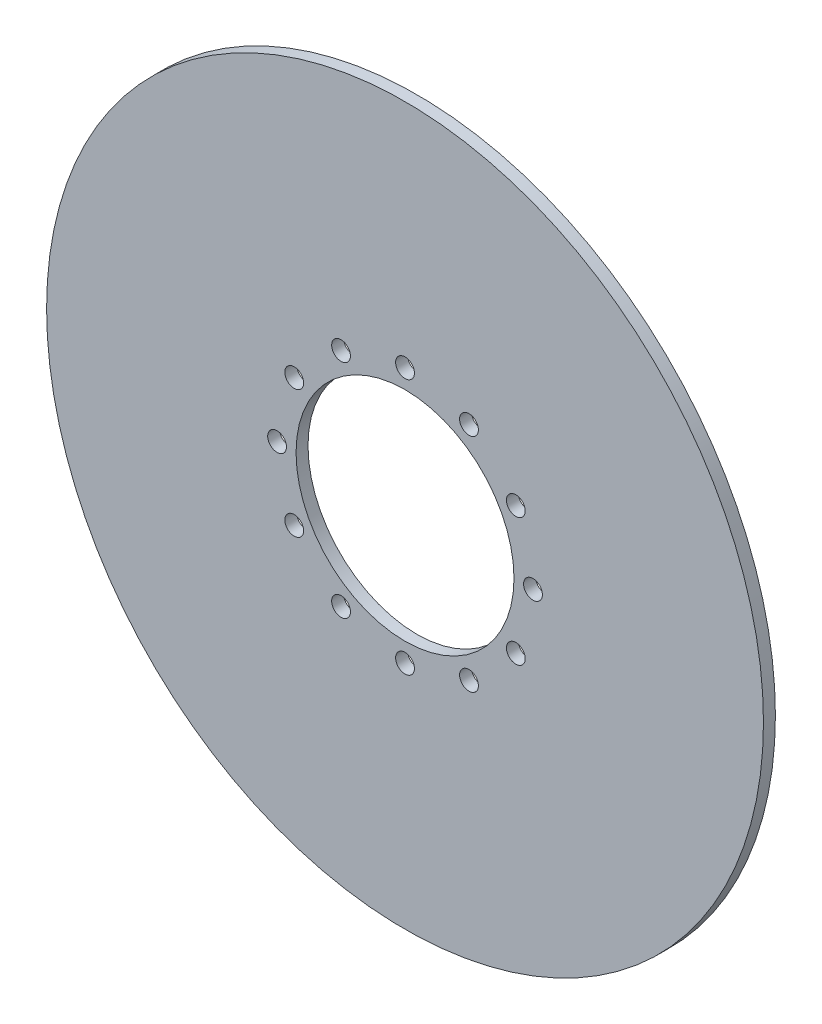
ISO-10303-21;
HEADER;
FILE_DESCRIPTION(('STEP AP214'),'2;1');
FILE_NAME('part.step','',(''),(''),'','','');
FILE_SCHEMA(('AUTOMOTIVE_DESIGN { 1 0 10303 214 1 1 1 1 }'));
ENDSEC;
DATA;
#1=APPLICATION_CONTEXT('core data for automotive mechanical design processes');
#2=APPLICATION_PROTOCOL_DEFINITION('international standard','automotive_design',2000,#1);
#3=PRODUCT_CONTEXT('',#1,'mechanical');
#4=PRODUCT('Part','Part','',(#3));
#5=PRODUCT_RELATED_PRODUCT_CATEGORY('part','',(#4));
#6=PRODUCT_DEFINITION_FORMATION('','',#4);
#7=PRODUCT_DEFINITION_CONTEXT('part definition',#1,'design');
#8=PRODUCT_DEFINITION('design','',#6,#7);
#9=PRODUCT_DEFINITION_SHAPE('','',#8);
#10=(LENGTH_UNIT() NAMED_UNIT(*) SI_UNIT(.MILLI.,.METRE.));
#11=(NAMED_UNIT(*) PLANE_ANGLE_UNIT() SI_UNIT($,.RADIAN.));
#12=(NAMED_UNIT(*) SI_UNIT($,.STERADIAN.) SOLID_ANGLE_UNIT());
#13=UNCERTAINTY_MEASURE_WITH_UNIT(LENGTH_MEASURE(1.E-05),#10,'distance_accuracy_value','');
#14=(GEOMETRIC_REPRESENTATION_CONTEXT(3) GLOBAL_UNCERTAINTY_ASSIGNED_CONTEXT((#13)) GLOBAL_UNIT_ASSIGNED_CONTEXT((#10,
#11,#12)) REPRESENTATION_CONTEXT('',''));
#15=CARTESIAN_POINT('',(0.,0.,0.));
#16=DIRECTION('',(0.,0.,1.));
#17=DIRECTION('',(1.,0.,0.));
#18=AXIS2_PLACEMENT_3D('',#15,#16,#17);
#19=CARTESIAN_POINT('',(0.,0.,3.175));
#20=DIRECTION('',(0.,0.,1.));
#21=DIRECTION('',(1.,0.,0.));
#22=AXIS2_PLACEMENT_3D('',#19,#20,#21);
#23=PLANE('',#22);
#24=CARTESIAN_POINT('',(-29.4448637286702,16.9999999999987,3.175));
#25=DIRECTION('',(0.,0.,1.));
#26=DIRECTION('',(1.,0.,0.));
#27=AXIS2_PLACEMENT_3D('',#24,#25,#26);
#28=CIRCLE('',#27,2.49698906987796);
#29=CARTESIAN_POINT('',(-26.9478746587923,16.9999999999987,3.175));
#30=VERTEX_POINT('',#29);
#31=EDGE_CURVE('E106',#30,#30,#28,.T.);
#32=ORIENTED_EDGE('',*,*,#31,.F.);
#33=EDGE_LOOP('',(#32));
#34=FACE_BOUND('',#33,.T.);
#35=CARTESIAN_POINT('',(-29.4448637286688,-17.0000000000013,3.175));
#36=DIRECTION('',(0.,0.,1.));
#37=DIRECTION('',(1.,0.,0.));
#38=AXIS2_PLACEMENT_3D('',#35,#36,#37);
#39=CIRCLE('',#38,2.49698906987796);
#40=CARTESIAN_POINT('',(-26.9478746587908,-17.0000000000013,3.175));
#41=VERTEX_POINT('',#40);
#42=EDGE_CURVE('E94',#41,#41,#39,.T.);
#43=ORIENTED_EDGE('',*,*,#42,.F.);
#44=EDGE_LOOP('',(#43));
#45=FACE_BOUND('',#44,.T.);
#46=CARTESIAN_POINT('',(2.86804195578331E-12,-34.,3.175));
#47=DIRECTION('',(0.,0.,1.));
#48=DIRECTION('',(1.,0.,0.));
#49=AXIS2_PLACEMENT_3D('',#46,#47,#48);
#50=CIRCLE('',#49,2.49698906987796);
#51=CARTESIAN_POINT('',(2.49698906988083,-34.,3.175));
#52=VERTEX_POINT('',#51);
#53=EDGE_CURVE('E82',#52,#52,#50,.T.);
#54=ORIENTED_EDGE('',*,*,#53,.F.);
#55=EDGE_LOOP('',(#54));
#56=FACE_BOUND('',#55,.T.);
#57=CARTESIAN_POINT('',(29.4448637286731,-16.9999999999988,3.175));
#58=DIRECTION('',(0.,0.,1.));
#59=DIRECTION('',(1.,0.,0.));
#60=AXIS2_PLACEMENT_3D('',#57,#58,#59);
#61=CIRCLE('',#60,2.49698906987769);
#62=CARTESIAN_POINT('',(31.9418527985508,-16.9999999999988,3.175));
#63=VERTEX_POINT('',#62);
#64=EDGE_CURVE('E70',#63,#63,#61,.T.);
#65=ORIENTED_EDGE('',*,*,#64,.F.);
#66=EDGE_LOOP('',(#65));
#67=FACE_BOUND('',#66,.T.);
#68=CARTESIAN_POINT('',(29.4448637286716,17.0000000000012,3.175));
#69=DIRECTION('',(0.,0.,1.));
#70=DIRECTION('',(1.,0.,0.));
#71=AXIS2_PLACEMENT_3D('',#68,#69,#70);
#72=CIRCLE('',#71,2.49698906987796);
#73=CARTESIAN_POINT('',(31.9418527985496,17.0000000000012,3.175));
#74=VERTEX_POINT('',#73);
#75=EDGE_CURVE('E58',#74,#74,#72,.T.);
#76=ORIENTED_EDGE('',*,*,#75,.F.);
#77=EDGE_LOOP('',(#76));
#78=FACE_BOUND('',#77,.T.);
#79=CARTESIAN_POINT('',(0.,34.,3.175));
#80=DIRECTION('',(0.,0.,1.));
#81=DIRECTION('',(1.,0.,0.));
#82=AXIS2_PLACEMENT_3D('',#79,#80,#81);
#83=CIRCLE('',#82,2.49698906987796);
#84=CARTESIAN_POINT('',(2.49698906987796,34.,3.175));
#85=VERTEX_POINT('',#84);
#86=EDGE_CURVE('E46',#85,#85,#83,.T.);
#87=ORIENTED_EDGE('',*,*,#86,.F.);
#88=EDGE_LOOP('',(#87));
#89=FACE_BOUND('',#88,.T.);
#90=CARTESIAN_POINT('',(0.,0.,3.175));
#91=DIRECTION('',(0.,0.,1.));
#92=DIRECTION('',(1.,0.,0.));
#93=AXIS2_PLACEMENT_3D('',#90,#91,#92);
#94=CIRCLE('',#93,95.25);
#95=CARTESIAN_POINT('',(95.25,0.,3.175));
#96=VERTEX_POINT('',#95);
#97=EDGE_CURVE('E10',#96,#96,#94,.T.);
#98=ORIENTED_EDGE('',*,*,#97,.T.);
#99=EDGE_LOOP('',(#98));
#100=FACE_BOUND('',#99,.T.);
#101=CARTESIAN_POINT('',(0.,0.,3.175));
#102=DIRECTION('',(0.,0.,1.));
#103=DIRECTION('',(1.,0.,0.));
#104=AXIS2_PLACEMENT_3D('',#101,#102,#103);
#105=CIRCLE('',#104,28.956);
#106=CARTESIAN_POINT('',(28.956,0.,3.175));
#107=VERTEX_POINT('',#106);
#108=EDGE_CURVE('E41',#107,#107,#105,.T.);
#109=ORIENTED_EDGE('',*,*,#108,.F.);
#110=EDGE_LOOP('',(#109));
#111=FACE_BOUND('',#110,.T.);
#112=CARTESIAN_POINT('',(17.0000000000002,29.4448637286716,3.175));
#113=DIRECTION('',(0.,0.,1.));
#114=DIRECTION('',(1.,0.,0.));
#115=AXIS2_PLACEMENT_3D('',#112,#113,#114);
#116=CIRCLE('',#115,2.49698906987796);
#117=CARTESIAN_POINT('',(19.4969890698782,29.4448637286716,3.175));
#118=VERTEX_POINT('',#117);
#119=EDGE_CURVE('E52',#118,#118,#116,.T.);
#120=ORIENTED_EDGE('',*,*,#119,.F.);
#121=EDGE_LOOP('',(#120));
#122=FACE_BOUND('',#121,.T.);
#123=CARTESIAN_POINT('',(34.0000000000014,1.43402097789165E-12,3.175));
#124=DIRECTION('',(0.,0.,1.));
#125=DIRECTION('',(1.,0.,0.));
#126=AXIS2_PLACEMENT_3D('',#123,#124,#125);
#127=CIRCLE('',#126,2.49698906987796);
#128=CARTESIAN_POINT('',(36.4969890698794,1.43402097789165E-12,3.175));
#129=VERTEX_POINT('',#128);
#130=EDGE_CURVE('E64',#129,#129,#127,.T.);
#131=ORIENTED_EDGE('',*,*,#130,.F.);
#132=EDGE_LOOP('',(#131));
#133=FACE_BOUND('',#132,.T.);
#134=CARTESIAN_POINT('',(17.0000000000027,-29.4448637286702,3.175));
#135=DIRECTION('',(0.,0.,1.));
#136=DIRECTION('',(1.,0.,0.));
#137=AXIS2_PLACEMENT_3D('',#134,#135,#136);
#138=CIRCLE('',#137,2.49698906987837);
#139=CARTESIAN_POINT('',(19.4969890698811,-29.4448637286702,3.175));
#140=VERTEX_POINT('',#139);
#141=EDGE_CURVE('E76',#140,#140,#138,.T.);
#142=ORIENTED_EDGE('',*,*,#141,.F.);
#143=EDGE_LOOP('',(#142));
#144=FACE_BOUND('',#143,.T.);
#145=CARTESIAN_POINT('',(-16.9999999999973,-29.4448637286716,3.175));
#146=DIRECTION('',(0.,0.,1.));
#147=DIRECTION('',(1.,0.,0.));
#148=AXIS2_PLACEMENT_3D('',#145,#146,#147);
#149=CIRCLE('',#148,2.49698906987796);
#150=CARTESIAN_POINT('',(-14.5030109301194,-29.4448637286716,3.175));
#151=VERTEX_POINT('',#150);
#152=EDGE_CURVE('E88',#151,#151,#149,.T.);
#153=ORIENTED_EDGE('',*,*,#152,.F.);
#154=EDGE_LOOP('',(#153));
#155=FACE_BOUND('',#154,.T.);
#156=CARTESIAN_POINT('',(-33.9999999999986,-1.43818477700875E-12,3.175));
#157=DIRECTION('',(0.,0.,1.));
#158=DIRECTION('',(1.,0.,0.));
#159=AXIS2_PLACEMENT_3D('',#156,#157,#158);
#160=CIRCLE('',#159,2.49698906987796);
#161=CARTESIAN_POINT('',(-31.5030109301206,-1.43818477700875E-12,3.175));
#162=VERTEX_POINT('',#161);
#163=EDGE_CURVE('E100',#162,#162,#160,.T.);
#164=ORIENTED_EDGE('',*,*,#163,.F.);
#165=EDGE_LOOP('',(#164));
#166=FACE_BOUND('',#165,.T.);
#167=CARTESIAN_POINT('',(-16.9999999999998,29.4448637286702,3.175));
#168=DIRECTION('',(0.,0.,1.));
#169=DIRECTION('',(1.,0.,0.));
#170=AXIS2_PLACEMENT_3D('',#167,#168,#169);
#171=CIRCLE('',#170,2.49698906987796);
#172=CARTESIAN_POINT('',(-14.5030109301219,29.4448637286702,3.175));
#173=VERTEX_POINT('',#172);
#174=EDGE_CURVE('E112',#173,#173,#171,.T.);
#175=ORIENTED_EDGE('',*,*,#174,.F.);
#176=EDGE_LOOP('',(#175));
#177=FACE_BOUND('',#176,.T.);
#178=ADVANCED_FACE('F30',(#34,#45,#56,#67,#78,#89,#100,#111,#122,#133,#144,#155,#166,#177),#23,.T.);
#179=CARTESIAN_POINT('',(0.,0.,0.));
#180=DIRECTION('',(0.,0.,1.));
#181=DIRECTION('',(1.,0.,0.));
#182=AXIS2_PLACEMENT_3D('',#179,#180,#181);
#183=PLANE('',#182);
#184=CARTESIAN_POINT('',(0.,0.,0.));
#185=DIRECTION('',(0.,0.,1.));
#186=DIRECTION('',(1.,0.,0.));
#187=AXIS2_PLACEMENT_3D('',#184,#185,#186);
#188=CIRCLE('',#187,95.25);
#189=CARTESIAN_POINT('',(95.25,0.,0.));
#190=VERTEX_POINT('',#189);
#191=EDGE_CURVE('E34',#190,#190,#188,.T.);
#192=ORIENTED_EDGE('',*,*,#191,.F.);
#193=EDGE_LOOP('',(#192));
#194=FACE_BOUND('',#193,.T.);
#195=CARTESIAN_POINT('',(0.,0.,0.));
#196=DIRECTION('',(0.,0.,1.));
#197=DIRECTION('',(1.,0.,0.));
#198=AXIS2_PLACEMENT_3D('',#195,#196,#197);
#199=CIRCLE('',#198,28.956);
#200=CARTESIAN_POINT('',(28.956,0.,0.));
#201=VERTEX_POINT('',#200);
#202=EDGE_CURVE('E43',#201,#201,#199,.T.);
#203=ORIENTED_EDGE('',*,*,#202,.T.);
#204=EDGE_LOOP('',(#203));
#205=FACE_BOUND('',#204,.T.);
#206=CARTESIAN_POINT('',(0.,34.,0.));
#207=DIRECTION('',(0.,0.,1.));
#208=DIRECTION('',(1.,0.,0.));
#209=AXIS2_PLACEMENT_3D('',#206,#207,#208);
#210=CIRCLE('',#209,2.49698906987796);
#211=CARTESIAN_POINT('',(2.49698906987796,34.,0.));
#212=VERTEX_POINT('',#211);
#213=EDGE_CURVE('E49',#212,#212,#210,.T.);
#214=ORIENTED_EDGE('',*,*,#213,.T.);
#215=EDGE_LOOP('',(#214));
#216=FACE_BOUND('',#215,.T.);
#217=CARTESIAN_POINT('',(17.0000000000002,29.4448637286716,0.));
#218=DIRECTION('',(0.,0.,1.));
#219=DIRECTION('',(1.,0.,0.));
#220=AXIS2_PLACEMENT_3D('',#217,#218,#219);
#221=CIRCLE('',#220,2.49698906987796);
#222=CARTESIAN_POINT('',(19.4969890698782,29.4448637286716,0.));
#223=VERTEX_POINT('',#222);
#224=EDGE_CURVE('E55',#223,#223,#221,.T.);
#225=ORIENTED_EDGE('',*,*,#224,.T.);
#226=EDGE_LOOP('',(#225));
#227=FACE_BOUND('',#226,.T.);
#228=CARTESIAN_POINT('',(29.4448637286716,17.0000000000012,0.));
#229=DIRECTION('',(0.,0.,1.));
#230=DIRECTION('',(1.,0.,0.));
#231=AXIS2_PLACEMENT_3D('',#228,#229,#230);
#232=CIRCLE('',#231,2.49698906987796);
#233=CARTESIAN_POINT('',(31.9418527985496,17.0000000000012,0.));
#234=VERTEX_POINT('',#233);
#235=EDGE_CURVE('E61',#234,#234,#232,.T.);
#236=ORIENTED_EDGE('',*,*,#235,.T.);
#237=EDGE_LOOP('',(#236));
#238=FACE_BOUND('',#237,.T.);
#239=CARTESIAN_POINT('',(34.0000000000014,1.43402097789165E-12,0.));
#240=DIRECTION('',(0.,0.,1.));
#241=DIRECTION('',(1.,0.,0.));
#242=AXIS2_PLACEMENT_3D('',#239,#240,#241);
#243=CIRCLE('',#242,2.49698906987796);
#244=CARTESIAN_POINT('',(36.4969890698794,1.43402097789165E-12,0.));
#245=VERTEX_POINT('',#244);
#246=EDGE_CURVE('E67',#245,#245,#243,.T.);
#247=ORIENTED_EDGE('',*,*,#246,.T.);
#248=EDGE_LOOP('',(#247));
#249=FACE_BOUND('',#248,.T.);
#250=CARTESIAN_POINT('',(29.4448637286731,-16.9999999999988,0.));
#251=DIRECTION('',(0.,0.,1.));
#252=DIRECTION('',(1.,0.,0.));
#253=AXIS2_PLACEMENT_3D('',#250,#251,#252);
#254=CIRCLE('',#253,2.49698906987769);
#255=CARTESIAN_POINT('',(31.9418527985508,-16.9999999999988,0.));
#256=VERTEX_POINT('',#255);
#257=EDGE_CURVE('E73',#256,#256,#254,.T.);
#258=ORIENTED_EDGE('',*,*,#257,.T.);
#259=EDGE_LOOP('',(#258));
#260=FACE_BOUND('',#259,.T.);
#261=CARTESIAN_POINT('',(17.0000000000027,-29.4448637286702,0.));
#262=DIRECTION('',(0.,0.,1.));
#263=DIRECTION('',(1.,0.,0.));
#264=AXIS2_PLACEMENT_3D('',#261,#262,#263);
#265=CIRCLE('',#264,2.49698906987837);
#266=CARTESIAN_POINT('',(19.4969890698811,-29.4448637286702,0.));
#267=VERTEX_POINT('',#266);
#268=EDGE_CURVE('E79',#267,#267,#265,.T.);
#269=ORIENTED_EDGE('',*,*,#268,.T.);
#270=EDGE_LOOP('',(#269));
#271=FACE_BOUND('',#270,.T.);
#272=CARTESIAN_POINT('',(2.86804195578331E-12,-34.,0.));
#273=DIRECTION('',(0.,0.,1.));
#274=DIRECTION('',(1.,0.,0.));
#275=AXIS2_PLACEMENT_3D('',#272,#273,#274);
#276=CIRCLE('',#275,2.49698906987796);
#277=CARTESIAN_POINT('',(2.49698906988083,-34.,0.));
#278=VERTEX_POINT('',#277);
#279=EDGE_CURVE('E85',#278,#278,#276,.T.);
#280=ORIENTED_EDGE('',*,*,#279,.T.);
#281=EDGE_LOOP('',(#280));
#282=FACE_BOUND('',#281,.T.);
#283=CARTESIAN_POINT('',(-16.9999999999973,-29.4448637286716,0.));
#284=DIRECTION('',(0.,0.,1.));
#285=DIRECTION('',(1.,0.,0.));
#286=AXIS2_PLACEMENT_3D('',#283,#284,#285);
#287=CIRCLE('',#286,2.49698906987796);
#288=CARTESIAN_POINT('',(-14.5030109301194,-29.4448637286716,0.));
#289=VERTEX_POINT('',#288);
#290=EDGE_CURVE('E91',#289,#289,#287,.T.);
#291=ORIENTED_EDGE('',*,*,#290,.T.);
#292=EDGE_LOOP('',(#291));
#293=FACE_BOUND('',#292,.T.);
#294=CARTESIAN_POINT('',(-29.4448637286688,-17.0000000000013,0.));
#295=DIRECTION('',(0.,0.,1.));
#296=DIRECTION('',(1.,0.,0.));
#297=AXIS2_PLACEMENT_3D('',#294,#295,#296);
#298=CIRCLE('',#297,2.49698906987796);
#299=CARTESIAN_POINT('',(-26.9478746587908,-17.0000000000013,0.));
#300=VERTEX_POINT('',#299);
#301=EDGE_CURVE('E97',#300,#300,#298,.T.);
#302=ORIENTED_EDGE('',*,*,#301,.T.);
#303=EDGE_LOOP('',(#302));
#304=FACE_BOUND('',#303,.T.);
#305=CARTESIAN_POINT('',(-33.9999999999986,-1.43818477700875E-12,0.));
#306=DIRECTION('',(0.,0.,1.));
#307=DIRECTION('',(1.,0.,0.));
#308=AXIS2_PLACEMENT_3D('',#305,#306,#307);
#309=CIRCLE('',#308,2.49698906987796);
#310=CARTESIAN_POINT('',(-31.5030109301206,-1.43818477700875E-12,0.));
#311=VERTEX_POINT('',#310);
#312=EDGE_CURVE('E103',#311,#311,#309,.T.);
#313=ORIENTED_EDGE('',*,*,#312,.T.);
#314=EDGE_LOOP('',(#313));
#315=FACE_BOUND('',#314,.T.);
#316=CARTESIAN_POINT('',(-29.4448637286702,16.9999999999987,0.));
#317=DIRECTION('',(0.,0.,1.));
#318=DIRECTION('',(1.,0.,0.));
#319=AXIS2_PLACEMENT_3D('',#316,#317,#318);
#320=CIRCLE('',#319,2.49698906987796);
#321=CARTESIAN_POINT('',(-26.9478746587923,16.9999999999987,0.));
#322=VERTEX_POINT('',#321);
#323=EDGE_CURVE('E109',#322,#322,#320,.T.);
#324=ORIENTED_EDGE('',*,*,#323,.T.);
#325=EDGE_LOOP('',(#324));
#326=FACE_BOUND('',#325,.T.);
#327=CARTESIAN_POINT('',(-16.9999999999998,29.4448637286702,0.));
#328=DIRECTION('',(0.,0.,1.));
#329=DIRECTION('',(1.,0.,0.));
#330=AXIS2_PLACEMENT_3D('',#327,#328,#329);
#331=CIRCLE('',#330,2.49698906987796);
#332=CARTESIAN_POINT('',(-14.5030109301219,29.4448637286702,0.));
#333=VERTEX_POINT('',#332);
#334=EDGE_CURVE('E115',#333,#333,#331,.T.);
#335=ORIENTED_EDGE('',*,*,#334,.T.);
#336=EDGE_LOOP('',(#335));
#337=FACE_BOUND('',#336,.T.);
#338=ADVANCED_FACE('F125',(#194,#205,#216,#227,#238,#249,#260,#271,#282,#293,#304,#315,#326,
#337),#183,.F.);
#339=CARTESIAN_POINT('',(0.,0.,3.175));
#340=DIRECTION('',(0.,0.,-1.));
#341=DIRECTION('',(-1.,0.,0.));
#342=AXIS2_PLACEMENT_3D('',#339,#340,#341);
#343=CYLINDRICAL_SURFACE('',#342,95.25);
#344=ORIENTED_EDGE('',*,*,#97,.F.);
#345=EDGE_LOOP('',(#344));
#346=FACE_BOUND('',#345,.T.);
#347=ORIENTED_EDGE('',*,*,#191,.T.);
#348=EDGE_LOOP('',(#347));
#349=FACE_BOUND('',#348,.T.);
#350=ADVANCED_FACE('F32',(#346,#349),#343,.T.);
#351=CARTESIAN_POINT('',(0.,0.,3.175));
#352=DIRECTION('',(0.,0.,-1.));
#353=DIRECTION('',(-1.,0.,0.));
#354=AXIS2_PLACEMENT_3D('',#351,#352,#353);
#355=CYLINDRICAL_SURFACE('',#354,28.956);
#356=ORIENTED_EDGE('',*,*,#108,.T.);
#357=EDGE_LOOP('',(#356));
#358=FACE_BOUND('',#357,.T.);
#359=ORIENTED_EDGE('',*,*,#202,.F.);
#360=EDGE_LOOP('',(#359));
#361=FACE_BOUND('',#360,.T.);
#362=ADVANCED_FACE('F135',(#358,#361),#355,.F.);
#363=CARTESIAN_POINT('',(0.,34.,3.175));
#364=DIRECTION('',(0.,0.,-1.));
#365=DIRECTION('',(-1.,0.,0.));
#366=AXIS2_PLACEMENT_3D('',#363,#364,#365);
#367=CYLINDRICAL_SURFACE('',#366,2.49698906987796);
#368=ORIENTED_EDGE('',*,*,#86,.T.);
#369=EDGE_LOOP('',(#368));
#370=FACE_BOUND('',#369,.T.);
#371=ORIENTED_EDGE('',*,*,#213,.F.);
#372=EDGE_LOOP('',(#371));
#373=FACE_BOUND('',#372,.T.);
#374=ADVANCED_FACE('F138',(#370,#373),#367,.F.);
#375=CARTESIAN_POINT('',(17.0000000000002,29.4448637286716,3.175));
#376=DIRECTION('',(0.,0.,-1.));
#377=DIRECTION('',(-1.,0.,0.));
#378=AXIS2_PLACEMENT_3D('',#375,#376,#377);
#379=CYLINDRICAL_SURFACE('',#378,2.49698906987796);
#380=ORIENTED_EDGE('',*,*,#119,.T.);
#381=EDGE_LOOP('',(#380));
#382=FACE_BOUND('',#381,.T.);
#383=ORIENTED_EDGE('',*,*,#224,.F.);
#384=EDGE_LOOP('',(#383));
#385=FACE_BOUND('',#384,.T.);
#386=ADVANCED_FACE('F142',(#382,#385),#379,.F.);
#387=CARTESIAN_POINT('',(29.4448637286716,17.0000000000012,3.175));
#388=DIRECTION('',(0.,0.,-1.));
#389=DIRECTION('',(-1.,0.,0.));
#390=AXIS2_PLACEMENT_3D('',#387,#388,#389);
#391=CYLINDRICAL_SURFACE('',#390,2.49698906987796);
#392=ORIENTED_EDGE('',*,*,#75,.T.);
#393=EDGE_LOOP('',(#392));
#394=FACE_BOUND('',#393,.T.);
#395=ORIENTED_EDGE('',*,*,#235,.F.);
#396=EDGE_LOOP('',(#395));
#397=FACE_BOUND('',#396,.T.);
#398=ADVANCED_FACE('F146',(#394,#397),#391,.F.);
#399=CARTESIAN_POINT('',(34.0000000000014,1.43402097789165E-12,3.175));
#400=DIRECTION('',(0.,0.,-1.));
#401=DIRECTION('',(-1.,0.,0.));
#402=AXIS2_PLACEMENT_3D('',#399,#400,#401);
#403=CYLINDRICAL_SURFACE('',#402,2.49698906987796);
#404=ORIENTED_EDGE('',*,*,#130,.T.);
#405=EDGE_LOOP('',(#404));
#406=FACE_BOUND('',#405,.T.);
#407=ORIENTED_EDGE('',*,*,#246,.F.);
#408=EDGE_LOOP('',(#407));
#409=FACE_BOUND('',#408,.T.);
#410=ADVANCED_FACE('F150',(#406,#409),#403,.F.);
#411=CARTESIAN_POINT('',(29.4448637286731,-16.9999999999988,3.175));
#412=DIRECTION('',(0.,0.,-1.));
#413=DIRECTION('',(-1.,0.,0.));
#414=AXIS2_PLACEMENT_3D('',#411,#412,#413);
#415=CYLINDRICAL_SURFACE('',#414,2.49698906987769);
#416=ORIENTED_EDGE('',*,*,#64,.T.);
#417=EDGE_LOOP('',(#416));
#418=FACE_BOUND('',#417,.T.);
#419=ORIENTED_EDGE('',*,*,#257,.F.);
#420=EDGE_LOOP('',(#419));
#421=FACE_BOUND('',#420,.T.);
#422=ADVANCED_FACE('F154',(#418,#421),#415,.F.);
#423=CARTESIAN_POINT('',(17.0000000000027,-29.4448637286702,3.175));
#424=DIRECTION('',(0.,0.,-1.));
#425=DIRECTION('',(-1.,0.,0.));
#426=AXIS2_PLACEMENT_3D('',#423,#424,#425);
#427=CYLINDRICAL_SURFACE('',#426,2.49698906987837);
#428=ORIENTED_EDGE('',*,*,#141,.T.);
#429=EDGE_LOOP('',(#428));
#430=FACE_BOUND('',#429,.T.);
#431=ORIENTED_EDGE('',*,*,#268,.F.);
#432=EDGE_LOOP('',(#431));
#433=FACE_BOUND('',#432,.T.);
#434=ADVANCED_FACE('F158',(#430,#433),#427,.F.);
#435=CARTESIAN_POINT('',(2.86804195578331E-12,-34.,3.175));
#436=DIRECTION('',(0.,0.,-1.));
#437=DIRECTION('',(-1.,0.,0.));
#438=AXIS2_PLACEMENT_3D('',#435,#436,#437);
#439=CYLINDRICAL_SURFACE('',#438,2.49698906987796);
#440=ORIENTED_EDGE('',*,*,#53,.T.);
#441=EDGE_LOOP('',(#440));
#442=FACE_BOUND('',#441,.T.);
#443=ORIENTED_EDGE('',*,*,#279,.F.);
#444=EDGE_LOOP('',(#443));
#445=FACE_BOUND('',#444,.T.);
#446=ADVANCED_FACE('F162',(#442,#445),#439,.F.);
#447=CARTESIAN_POINT('',(-16.9999999999973,-29.4448637286716,3.175));
#448=DIRECTION('',(0.,0.,-1.));
#449=DIRECTION('',(-1.,0.,0.));
#450=AXIS2_PLACEMENT_3D('',#447,#448,#449);
#451=CYLINDRICAL_SURFACE('',#450,2.49698906987796);
#452=ORIENTED_EDGE('',*,*,#152,.T.);
#453=EDGE_LOOP('',(#452));
#454=FACE_BOUND('',#453,.T.);
#455=ORIENTED_EDGE('',*,*,#290,.F.);
#456=EDGE_LOOP('',(#455));
#457=FACE_BOUND('',#456,.T.);
#458=ADVANCED_FACE('F166',(#454,#457),#451,.F.);
#459=CARTESIAN_POINT('',(-29.4448637286688,-17.0000000000013,3.175));
#460=DIRECTION('',(0.,0.,-1.));
#461=DIRECTION('',(-1.,0.,0.));
#462=AXIS2_PLACEMENT_3D('',#459,#460,#461);
#463=CYLINDRICAL_SURFACE('',#462,2.49698906987796);
#464=ORIENTED_EDGE('',*,*,#42,.T.);
#465=EDGE_LOOP('',(#464));
#466=FACE_BOUND('',#465,.T.);
#467=ORIENTED_EDGE('',*,*,#301,.F.);
#468=EDGE_LOOP('',(#467));
#469=FACE_BOUND('',#468,.T.);
#470=ADVANCED_FACE('F170',(#466,#469),#463,.F.);
#471=CARTESIAN_POINT('',(-33.9999999999986,-1.43818477700875E-12,3.175));
#472=DIRECTION('',(0.,0.,-1.));
#473=DIRECTION('',(-1.,0.,0.));
#474=AXIS2_PLACEMENT_3D('',#471,#472,#473);
#475=CYLINDRICAL_SURFACE('',#474,2.49698906987796);
#476=ORIENTED_EDGE('',*,*,#163,.T.);
#477=EDGE_LOOP('',(#476));
#478=FACE_BOUND('',#477,.T.);
#479=ORIENTED_EDGE('',*,*,#312,.F.);
#480=EDGE_LOOP('',(#479));
#481=FACE_BOUND('',#480,.T.);
#482=ADVANCED_FACE('F174',(#478,#481),#475,.F.);
#483=CARTESIAN_POINT('',(-29.4448637286702,16.9999999999987,3.175));
#484=DIRECTION('',(0.,0.,-1.));
#485=DIRECTION('',(-1.,0.,0.));
#486=AXIS2_PLACEMENT_3D('',#483,#484,#485);
#487=CYLINDRICAL_SURFACE('',#486,2.49698906987796);
#488=ORIENTED_EDGE('',*,*,#31,.T.);
#489=EDGE_LOOP('',(#488));
#490=FACE_BOUND('',#489,.T.);
#491=ORIENTED_EDGE('',*,*,#323,.F.);
#492=EDGE_LOOP('',(#491));
#493=FACE_BOUND('',#492,.T.);
#494=ADVANCED_FACE('F178',(#490,#493),#487,.F.);
#495=CARTESIAN_POINT('',(-16.9999999999998,29.4448637286702,3.175));
#496=DIRECTION('',(0.,0.,-1.));
#497=DIRECTION('',(-1.,0.,0.));
#498=AXIS2_PLACEMENT_3D('',#495,#496,#497);
#499=CYLINDRICAL_SURFACE('',#498,2.49698906987796);
#500=ORIENTED_EDGE('',*,*,#174,.T.);
#501=EDGE_LOOP('',(#500));
#502=FACE_BOUND('',#501,.T.);
#503=ORIENTED_EDGE('',*,*,#334,.F.);
#504=EDGE_LOOP('',(#503));
#505=FACE_BOUND('',#504,.T.);
#506=ADVANCED_FACE('F121',(#502,#505),#499,.F.);
#507=CLOSED_SHELL('',(#178,#338,#350,#362,#374,#386,#398,#410,#422,#434,#446,#458,#470,#482,
#494,#506));
#508=MANIFOLD_SOLID_BREP('B2',#507);
#509=ADVANCED_BREP_SHAPE_REPRESENTATION('',(#18,#508),#14);
#510=SHAPE_DEFINITION_REPRESENTATION(#9,#509);
ENDSEC;
END-ISO-10303-21;
